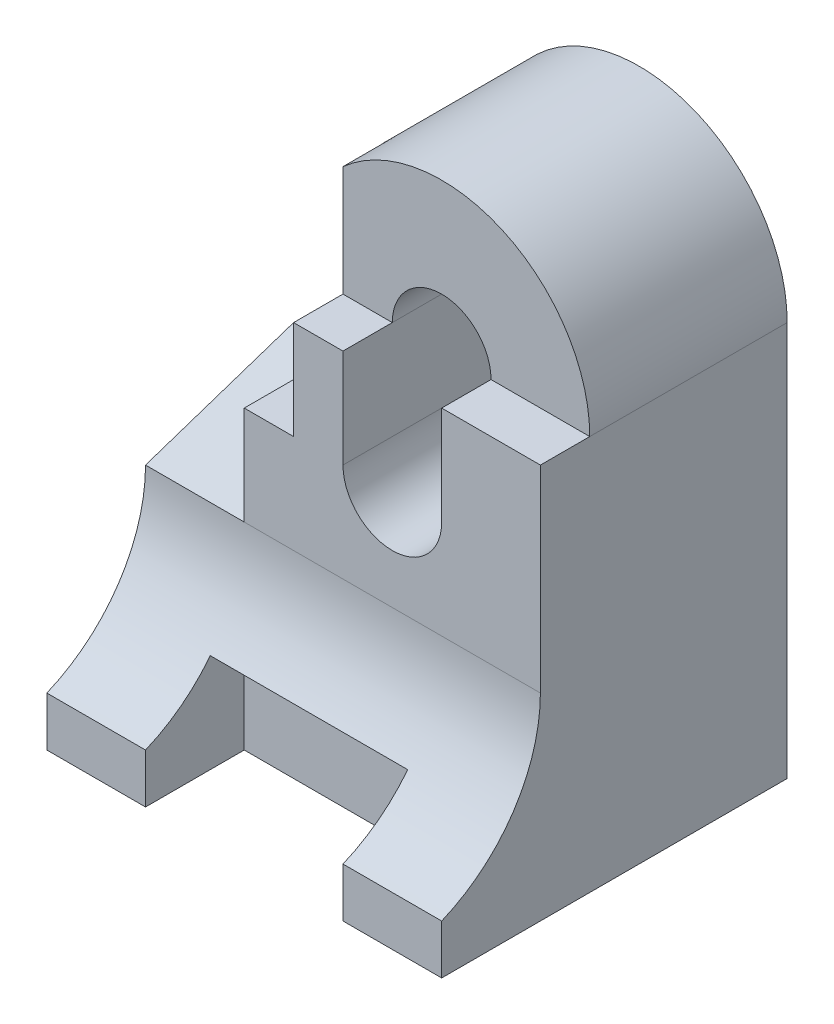
ISO-10303-21;
HEADER;
FILE_DESCRIPTION(('STEP AP214'),'2;1');
FILE_NAME('part.step','',(''),(''),'','','');
FILE_SCHEMA(('AUTOMOTIVE_DESIGN { 1 0 10303 214 1 1 1 1 }'));
ENDSEC;
DATA;
#1=APPLICATION_CONTEXT('core data for automotive mechanical design processes');
#2=APPLICATION_PROTOCOL_DEFINITION('international standard','automotive_design',2000,#1);
#3=PRODUCT_CONTEXT('',#1,'mechanical');
#4=PRODUCT('Part','Part','',(#3));
#5=PRODUCT_RELATED_PRODUCT_CATEGORY('part','',(#4));
#6=PRODUCT_DEFINITION_FORMATION('','',#4);
#7=PRODUCT_DEFINITION_CONTEXT('part definition',#1,'design');
#8=PRODUCT_DEFINITION('design','',#6,#7);
#9=PRODUCT_DEFINITION_SHAPE('','',#8);
#10=(LENGTH_UNIT() NAMED_UNIT(*) SI_UNIT(.MILLI.,.METRE.));
#11=(NAMED_UNIT(*) PLANE_ANGLE_UNIT() SI_UNIT($,.RADIAN.));
#12=(NAMED_UNIT(*) SI_UNIT($,.STERADIAN.) SOLID_ANGLE_UNIT());
#13=UNCERTAINTY_MEASURE_WITH_UNIT(LENGTH_MEASURE(1.E-05),#10,'distance_accuracy_value','');
#14=(GEOMETRIC_REPRESENTATION_CONTEXT(3) GLOBAL_UNCERTAINTY_ASSIGNED_CONTEXT((#13)) GLOBAL_UNIT_ASSIGNED_CONTEXT((#10,
#11,#12)) REPRESENTATION_CONTEXT('',''));
#15=CARTESIAN_POINT('',(0.,0.,0.));
#16=DIRECTION('',(0.,0.,1.));
#17=DIRECTION('',(1.,0.,0.));
#18=AXIS2_PLACEMENT_3D('',#15,#16,#17);
#19=CARTESIAN_POINT('',(-2.,2.,5.));
#20=DIRECTION('',(1.,0.,0.));
#21=DIRECTION('',(0.,0.,-1.));
#22=AXIS2_PLACEMENT_3D('',#19,#20,#21);
#23=PLANE('',#22);
#24=DIRECTION('',(0.,0.316227766016838,-0.948683298050514));
#25=VECTOR('',#24,1.);
#26=CARTESIAN_POINT('',(-2.,3.,2.));
#27=LINE('',#26,#25);
#28=CARTESIAN_POINT('',(-2.,2.,5.));
#29=VERTEX_POINT('',#28);
#30=CARTESIAN_POINT('',(-2.,3.,2.));
#31=VERTEX_POINT('',#30);
#32=EDGE_CURVE('E478',#29,#31,#27,.T.);
#33=ORIENTED_EDGE('',*,*,#32,.F.);
#34=DIRECTION('',(0.,-1.,0.));
#35=VECTOR('',#34,1.);
#36=CARTESIAN_POINT('',(-2.,2.,5.));
#37=LINE('',#36,#35);
#38=CARTESIAN_POINT('',(-2.,4.,5.));
#39=VERTEX_POINT('',#38);
#40=EDGE_CURVE('E217',#39,#29,#37,.T.);
#41=ORIENTED_EDGE('',*,*,#40,.F.);
#42=DIRECTION('',(0.,0.,1.));
#43=VECTOR('',#42,1.);
#44=CARTESIAN_POINT('',(-2.,4.,3.));
#45=LINE('',#44,#43);
#46=CARTESIAN_POINT('',(-2.,4.,3.));
#47=VERTEX_POINT('',#46);
#48=EDGE_CURVE('E440',#47,#39,#45,.T.);
#49=ORIENTED_EDGE('',*,*,#48,.F.);
#50=DIRECTION('',(0.,-1.,0.));
#51=VECTOR('',#50,1.);
#52=CARTESIAN_POINT('',(-2.,4.,3.));
#53=LINE('',#52,#51);
#54=CARTESIAN_POINT('',(-2.,5.99999999999998,3.));
#55=VERTEX_POINT('',#54);
#56=EDGE_CURVE('E449',#55,#47,#53,.T.);
#57=ORIENTED_EDGE('',*,*,#56,.F.);
#58=DIRECTION('',(0.,0.,-1.));
#59=VECTOR('',#58,1.);
#60=CARTESIAN_POINT('',(-2.,6.,5.));
#61=LINE('',#60,#59);
#62=CARTESIAN_POINT('',(-2.,6.,1.));
#63=VERTEX_POINT('',#62);
#64=EDGE_CURVE('E216',#55,#63,#61,.T.);
#65=ORIENTED_EDGE('',*,*,#64,.T.);
#66=DIRECTION('',(0.,-1.,0.));
#67=VECTOR('',#66,1.);
#68=CARTESIAN_POINT('',(-2.,6.,1.));
#69=LINE('',#68,#67);
#70=CARTESIAN_POINT('',(-2.,3.,1.));
#71=VERTEX_POINT('',#70);
#72=EDGE_CURVE('E464',#63,#71,#69,.T.);
#73=ORIENTED_EDGE('',*,*,#72,.T.);
#74=DIRECTION('',(0.,0.,-1.));
#75=VECTOR('',#74,1.);
#76=CARTESIAN_POINT('',(-2.,3.,1.));
#77=LINE('',#76,#75);
#78=EDGE_CURVE('E205',#31,#71,#77,.T.);
#79=ORIENTED_EDGE('',*,*,#78,.F.);
#80=EDGE_LOOP('',(#33,#41,#49,#57,#65,#73,#79));
#81=FACE_BOUND('',#80,.T.);
#82=ADVANCED_FACE('F33',(#81),#23,.F.);
#83=CARTESIAN_POINT('',(0.,0.,1.));
#84=DIRECTION('',(0.,0.,-1.));
#85=DIRECTION('',(-1.,0.,0.));
#86=AXIS2_PLACEMENT_3D('',#83,#84,#85);
#87=PLANE('',#86);
#88=DIRECTION('',(1.,0.,0.));
#89=VECTOR('',#88,1.);
#90=CARTESIAN_POINT('',(-4.,3.,1.));
#91=LINE('',#90,#89);
#92=CARTESIAN_POINT('',(-4.,3.,1.));
#93=VERTEX_POINT('',#92);
#94=EDGE_CURVE('E474',#93,#71,#91,.T.);
#95=ORIENTED_EDGE('',*,*,#94,.T.);
#96=ORIENTED_EDGE('',*,*,#72,.F.);
#97=DIRECTION('',(0.554700196225229,0.832050294337844,0.));
#98=VECTOR('',#97,1.);
#99=CARTESIAN_POINT('',(-4.,3.,1.));
#100=LINE('',#99,#98);
#101=EDGE_CURVE('E468',#93,#63,#100,.T.);
#102=ORIENTED_EDGE('',*,*,#101,.F.);
#103=EDGE_LOOP('',(#95,#96,#102));
#104=FACE_BOUND('',#103,.T.);
#105=ADVANCED_FACE('F371',(#104),#87,.F.);
#106=CARTESIAN_POINT('',(1.,6.,5.));
#107=DIRECTION('',(0.,0.,-1.));
#108=DIRECTION('',(-1.,0.,0.));
#109=AXIS2_PLACEMENT_3D('',#106,#107,#108);
#110=CYLINDRICAL_SURFACE('',#109,3.);
#111=CARTESIAN_POINT('',(1.,6.,3.));
#112=DIRECTION('',(0.,0.,1.));
#113=DIRECTION('',(1.,0.,0.));
#114=AXIS2_PLACEMENT_3D('',#111,#112,#113);
#115=CIRCLE('',#114,3.);
#116=CARTESIAN_POINT('',(-1.,8.23606797749979,3.));
#117=VERTEX_POINT('',#116);
#118=EDGE_CURVE('E443',#117,#55,#115,.T.);
#119=ORIENTED_EDGE('',*,*,#118,.F.);
#120=DIRECTION('',(0.,0.,1.));
#121=VECTOR('',#120,1.);
#122=CARTESIAN_POINT('',(-1.,8.23606797749979,3.));
#123=LINE('',#122,#121);
#124=CARTESIAN_POINT('',(-1.,8.23606797749979,4.));
#125=VERTEX_POINT('',#124);
#126=EDGE_CURVE('E433',#117,#125,#123,.T.);
#127=ORIENTED_EDGE('',*,*,#126,.T.);
#128=CARTESIAN_POINT('',(1.,6.,4.));
#129=DIRECTION('',(0.,0.,1.));
#130=DIRECTION('',(1.,0.,0.));
#131=AXIS2_PLACEMENT_3D('',#128,#129,#130);
#132=CIRCLE('',#131,3.);
#133=CARTESIAN_POINT('',(4.,6.,4.));
#134=VERTEX_POINT('',#133);
#135=EDGE_CURVE('E427',#134,#125,#132,.T.);
#136=ORIENTED_EDGE('',*,*,#135,.F.);
#137=DIRECTION('',(0.,0.,-1.));
#138=VECTOR('',#137,1.);
#139=CARTESIAN_POINT('',(4.,6.,5.));
#140=LINE('',#139,#138);
#141=CARTESIAN_POINT('',(4.,6.,0.));
#142=VERTEX_POINT('',#141);
#143=EDGE_CURVE('E292',#134,#142,#140,.T.);
#144=ORIENTED_EDGE('',*,*,#143,.T.);
#145=CARTESIAN_POINT('',(1.,6.,0.));
#146=DIRECTION('',(0.,0.,1.));
#147=DIRECTION('',(-1.,0.,0.));
#148=AXIS2_PLACEMENT_3D('',#145,#146,#147);
#149=CIRCLE('',#148,3.);
#150=CARTESIAN_POINT('',(-2.,6.,0.));
#151=VERTEX_POINT('',#150);
#152=EDGE_CURVE('E280',#142,#151,#149,.T.);
#153=ORIENTED_EDGE('',*,*,#152,.T.);
#154=DIRECTION('',(0.,0.,-1.));
#155=VECTOR('',#154,1.);
#156=CARTESIAN_POINT('',(-2.,6.,1.));
#157=LINE('',#156,#155);
#158=EDGE_CURVE('E48',#63,#151,#157,.T.);
#159=ORIENTED_EDGE('',*,*,#158,.F.);
#160=ORIENTED_EDGE('',*,*,#64,.F.);
#161=EDGE_LOOP('',(#119,#127,#136,#144,#153,#159,#160));
#162=FACE_BOUND('',#161,.T.);
#163=ADVANCED_FACE('F377',(#162),#110,.T.);
#164=CARTESIAN_POINT('',(1.,6.,5.));
#165=DIRECTION('',(0.,0.,-1.));
#166=DIRECTION('',(-1.,0.,0.));
#167=AXIS2_PLACEMENT_3D('',#164,#165,#166);
#168=CYLINDRICAL_SURFACE('',#167,1.);
#169=DIRECTION('',(0.,0.,-1.));
#170=VECTOR('',#169,1.);
#171=CARTESIAN_POINT('',(2.,6.,5.));
#172=LINE('',#171,#170);
#173=CARTESIAN_POINT('',(2.,6.,4.));
#174=VERTEX_POINT('',#173);
#175=CARTESIAN_POINT('',(2.,6.,0.));
#176=VERTEX_POINT('',#175);
#177=EDGE_CURVE('E254',#174,#176,#172,.T.);
#178=ORIENTED_EDGE('',*,*,#177,.F.);
#179=CARTESIAN_POINT('',(1.,6.,4.));
#180=DIRECTION('',(0.,0.,-1.));
#181=DIRECTION('',(-1.,0.,0.));
#182=AXIS2_PLACEMENT_3D('',#179,#180,#181);
#183=CIRCLE('',#182,1.);
#184=CARTESIAN_POINT('',(0.,6.,4.));
#185=VERTEX_POINT('',#184);
#186=EDGE_CURVE('E414',#185,#174,#183,.T.);
#187=ORIENTED_EDGE('',*,*,#186,.F.);
#188=DIRECTION('',(0.,0.,-1.));
#189=VECTOR('',#188,1.);
#190=CARTESIAN_POINT('',(0.,6.,5.));
#191=LINE('',#190,#189);
#192=CARTESIAN_POINT('',(0.,6.,0.));
#193=VERTEX_POINT('',#192);
#194=EDGE_CURVE('E272',#185,#193,#191,.T.);
#195=ORIENTED_EDGE('',*,*,#194,.T.);
#196=CARTESIAN_POINT('',(1.,6.,0.));
#197=DIRECTION('',(0.,0.,1.));
#198=DIRECTION('',(1.,0.,0.));
#199=AXIS2_PLACEMENT_3D('',#196,#197,#198);
#200=CIRCLE('',#199,1.);
#201=EDGE_CURVE('E239',#176,#193,#200,.T.);
#202=ORIENTED_EDGE('',*,*,#201,.F.);
#203=EDGE_LOOP('',(#178,#187,#195,#202));
#204=FACE_BOUND('',#203,.T.);
#205=ADVANCED_FACE('F368',(#204),#168,.F.);
#206=CARTESIAN_POINT('',(-4.,-2.,7.));
#207=DIRECTION('',(0.,0.,1.));
#208=DIRECTION('',(1.,0.,0.));
#209=AXIS2_PLACEMENT_3D('',#206,#207,#208);
#210=PLANE('',#209);
#211=DIRECTION('',(0.,-1.,0.));
#212=VECTOR('',#211,1.);
#213=CARTESIAN_POINT('',(2.,0.,7.));
#214=LINE('',#213,#212);
#215=CARTESIAN_POINT('',(2.,-1.,7.));
#216=VERTEX_POINT('',#215);
#217=CARTESIAN_POINT('',(2.,-2.,7.));
#218=VERTEX_POINT('',#217);
#219=EDGE_CURVE('E234',#216,#218,#214,.T.);
#220=ORIENTED_EDGE('',*,*,#219,.T.);
#221=DIRECTION('',(1.,0.,0.));
#222=VECTOR('',#221,1.);
#223=CARTESIAN_POINT('',(-4.,-2.,7.));
#224=LINE('',#223,#222);
#225=CARTESIAN_POINT('',(4.,-2.,7.));
#226=VERTEX_POINT('',#225);
#227=EDGE_CURVE('E240',#218,#226,#224,.T.);
#228=ORIENTED_EDGE('',*,*,#227,.T.);
#229=DIRECTION('',(0.,-1.,0.));
#230=VECTOR('',#229,1.);
#231=CARTESIAN_POINT('',(4.,-2.,7.));
#232=LINE('',#231,#230);
#233=CARTESIAN_POINT('',(4.,-1.,7.));
#234=VERTEX_POINT('',#233);
#235=EDGE_CURVE('E223',#234,#226,#232,.T.);
#236=ORIENTED_EDGE('',*,*,#235,.F.);
#237=DIRECTION('',(1.,0.,0.));
#238=VECTOR('',#237,1.);
#239=CARTESIAN_POINT('',(-4.,-1.,7.));
#240=LINE('',#239,#238);
#241=EDGE_CURVE('E243',#216,#234,#240,.T.);
#242=ORIENTED_EDGE('',*,*,#241,.F.);
#243=EDGE_LOOP('',(#220,#228,#236,#242));
#244=FACE_BOUND('',#243,.T.);
#245=ADVANCED_FACE('F356',(#244),#210,.T.);
#246=CARTESIAN_POINT('',(1.,6.,5.));
#247=DIRECTION('',(0.,0.,-1.));
#248=DIRECTION('',(-1.,0.,0.));
#249=AXIS2_PLACEMENT_3D('',#246,#247,#248);
#250=PLANE('',#249);
#251=DIRECTION('',(1.,0.,0.));
#252=VECTOR('',#251,1.);
#253=CARTESIAN_POINT('',(0.,6.,5.));
#254=LINE('',#253,#252);
#255=CARTESIAN_POINT('',(-1.,5.99999999999998,5.));
#256=VERTEX_POINT('',#255);
#257=CARTESIAN_POINT('',(0.,6.,5.));
#258=VERTEX_POINT('',#257);
#259=EDGE_CURVE('E428',#256,#258,#254,.T.);
#260=ORIENTED_EDGE('',*,*,#259,.F.);
#261=DIRECTION('',(0.,1.,0.));
#262=VECTOR('',#261,1.);
#263=CARTESIAN_POINT('',(-1.,4.,5.));
#264=LINE('',#263,#262);
#265=CARTESIAN_POINT('',(-1.,4.,5.));
#266=VERTEX_POINT('',#265);
#267=EDGE_CURVE('E447',#266,#256,#264,.T.);
#268=ORIENTED_EDGE('',*,*,#267,.F.);
#269=DIRECTION('',(1.,0.,0.));
#270=VECTOR('',#269,1.);
#271=CARTESIAN_POINT('',(-2.,4.,5.));
#272=LINE('',#271,#270);
#273=EDGE_CURVE('E450',#39,#266,#272,.T.);
#274=ORIENTED_EDGE('',*,*,#273,.F.);
#275=ORIENTED_EDGE('',*,*,#40,.T.);
#276=DIRECTION('',(1.,0.,0.));
#277=VECTOR('',#276,1.);
#278=CARTESIAN_POINT('',(-4.,2.,5.));
#279=LINE('',#278,#277);
#280=CARTESIAN_POINT('',(4.,2.,5.));
#281=VERTEX_POINT('',#280);
#282=EDGE_CURVE('E215',#29,#281,#279,.T.);
#283=ORIENTED_EDGE('',*,*,#282,.T.);
#284=DIRECTION('',(0.,1.,0.));
#285=VECTOR('',#284,1.);
#286=CARTESIAN_POINT('',(4.,-2.,5.));
#287=LINE('',#286,#285);
#288=CARTESIAN_POINT('',(4.,6.,5.));
#289=VERTEX_POINT('',#288);
#290=EDGE_CURVE('E277',#281,#289,#287,.T.);
#291=ORIENTED_EDGE('',*,*,#290,.T.);
#292=DIRECTION('',(1.,0.,0.));
#293=VECTOR('',#292,1.);
#294=CARTESIAN_POINT('',(4.,6.,5.));
#295=LINE('',#294,#293);
#296=CARTESIAN_POINT('',(2.,6.,5.));
#297=VERTEX_POINT('',#296);
#298=EDGE_CURVE('E332',#297,#289,#295,.T.);
#299=ORIENTED_EDGE('',*,*,#298,.F.);
#300=DIRECTION('',(0.,1.,0.));
#301=VECTOR('',#300,1.);
#302=CARTESIAN_POINT('',(2.,6.,5.));
#303=LINE('',#302,#301);
#304=CARTESIAN_POINT('',(2.,4.,5.));
#305=VERTEX_POINT('',#304);
#306=EDGE_CURVE('E251',#305,#297,#303,.T.);
#307=ORIENTED_EDGE('',*,*,#306,.F.);
#308=CARTESIAN_POINT('',(1.,4.,5.));
#309=DIRECTION('',(0.,0.,1.));
#310=DIRECTION('',(1.,0.,0.));
#311=AXIS2_PLACEMENT_3D('',#308,#309,#310);
#312=CIRCLE('',#311,1.);
#313=CARTESIAN_POINT('',(0.,4.,5.));
#314=VERTEX_POINT('',#313);
#315=EDGE_CURVE('E247',#314,#305,#312,.T.);
#316=ORIENTED_EDGE('',*,*,#315,.F.);
#317=DIRECTION('',(0.,-1.,0.));
#318=VECTOR('',#317,1.);
#319=CARTESIAN_POINT('',(0.,6.,5.));
#320=LINE('',#319,#318);
#321=EDGE_CURVE('E245',#258,#314,#320,.T.);
#322=ORIENTED_EDGE('',*,*,#321,.F.);
#323=EDGE_LOOP('',(#260,#268,#274,#275,#283,#291,#299,#307,#316,#322));
#324=FACE_BOUND('',#323,.T.);
#325=ADVANCED_FACE('F367',(#324),#250,.F.);
#326=CARTESIAN_POINT('',(1.,6.,0.));
#327=DIRECTION('',(0.,0.,-1.));
#328=DIRECTION('',(-1.,0.,0.));
#329=AXIS2_PLACEMENT_3D('',#326,#327,#328);
#330=PLANE('',#329);
#331=DIRECTION('',(0.,-1.,0.));
#332=VECTOR('',#331,1.);
#333=CARTESIAN_POINT('',(-4.,-2.,0.));
#334=LINE('',#333,#332);
#335=CARTESIAN_POINT('',(-4.,3.,0.));
#336=VERTEX_POINT('',#335);
#337=CARTESIAN_POINT('',(-4.,-2.,0.));
#338=VERTEX_POINT('',#337);
#339=EDGE_CURVE('E276',#336,#338,#334,.T.);
#340=ORIENTED_EDGE('',*,*,#339,.F.);
#341=DIRECTION('',(0.554700196225229,0.832050294337844,0.));
#342=VECTOR('',#341,1.);
#343=CARTESIAN_POINT('',(-4.,3.,0.));
#344=LINE('',#343,#342);
#345=EDGE_CURVE('E466',#336,#151,#344,.T.);
#346=ORIENTED_EDGE('',*,*,#345,.T.);
#347=ORIENTED_EDGE('',*,*,#152,.F.);
#348=DIRECTION('',(0.,1.,0.));
#349=VECTOR('',#348,1.);
#350=CARTESIAN_POINT('',(4.,2.,0.));
#351=LINE('',#350,#349);
#352=CARTESIAN_POINT('',(4.,-2.,0.));
#353=VERTEX_POINT('',#352);
#354=EDGE_CURVE('E287',#353,#142,#351,.T.);
#355=ORIENTED_EDGE('',*,*,#354,.F.);
#356=DIRECTION('',(1.,0.,0.));
#357=VECTOR('',#356,1.);
#358=CARTESIAN_POINT('',(4.,-2.,0.));
#359=LINE('',#358,#357);
#360=EDGE_CURVE('E284',#338,#353,#359,.T.);
#361=ORIENTED_EDGE('',*,*,#360,.F.);
#362=EDGE_LOOP('',(#340,#346,#347,#355,#361));
#363=FACE_BOUND('',#362,.T.);
#364=DIRECTION('',(0.,1.,0.));
#365=VECTOR('',#364,1.);
#366=CARTESIAN_POINT('',(2.,6.,0.));
#367=LINE('',#366,#365);
#368=CARTESIAN_POINT('',(2.,4.,0.));
#369=VERTEX_POINT('',#368);
#370=EDGE_CURVE('E248',#369,#176,#367,.T.);
#371=ORIENTED_EDGE('',*,*,#370,.T.);
#372=ORIENTED_EDGE('',*,*,#201,.T.);
#373=DIRECTION('',(0.,-1.,0.));
#374=VECTOR('',#373,1.);
#375=CARTESIAN_POINT('',(0.,6.,0.));
#376=LINE('',#375,#374);
#377=CARTESIAN_POINT('',(0.,4.,0.));
#378=VERTEX_POINT('',#377);
#379=EDGE_CURVE('E257',#193,#378,#376,.T.);
#380=ORIENTED_EDGE('',*,*,#379,.T.);
#381=CARTESIAN_POINT('',(1.,4.,0.));
#382=DIRECTION('',(0.,0.,1.));
#383=DIRECTION('',(1.,0.,0.));
#384=AXIS2_PLACEMENT_3D('',#381,#382,#383);
#385=CIRCLE('',#384,1.);
#386=EDGE_CURVE('E260',#378,#369,#385,.T.);
#387=ORIENTED_EDGE('',*,*,#386,.T.);
#388=EDGE_LOOP('',(#371,#372,#380,#387));
#389=FACE_BOUND('',#388,.T.);
#390=ADVANCED_FACE('F382',(#363,#389),#330,.T.);
#391=CARTESIAN_POINT('',(-4.,-2.,5.));
#392=DIRECTION('',(1.,0.,0.));
#393=DIRECTION('',(0.,0.,-1.));
#394=AXIS2_PLACEMENT_3D('',#391,#392,#393);
#395=PLANE('',#394);
#396=ORIENTED_EDGE('',*,*,#339,.T.);
#397=DIRECTION('',(0.,0.,-1.));
#398=VECTOR('',#397,1.);
#399=CARTESIAN_POINT('',(-4.,-2.,5.));
#400=LINE('',#399,#398);
#401=CARTESIAN_POINT('',(-4.,-2.,7.));
#402=VERTEX_POINT('',#401);
#403=EDGE_CURVE('E298',#402,#338,#400,.T.);
#404=ORIENTED_EDGE('',*,*,#403,.F.);
#405=DIRECTION('',(0.,-1.,0.));
#406=VECTOR('',#405,1.);
#407=CARTESIAN_POINT('',(-4.,-2.,7.));
#408=LINE('',#407,#406);
#409=CARTESIAN_POINT('',(-4.,-1.,7.));
#410=VERTEX_POINT('',#409);
#411=EDGE_CURVE('E222',#410,#402,#408,.T.);
#412=ORIENTED_EDGE('',*,*,#411,.F.);
#413=CARTESIAN_POINT('',(-4.,2.,8.25));
#414=DIRECTION('',(-1.,0.,0.));
#415=DIRECTION('',(0.,0.,-1.));
#416=AXIS2_PLACEMENT_3D('',#413,#414,#415);
#417=CIRCLE('',#416,3.25);
#418=CARTESIAN_POINT('',(-4.,2.,5.));
#419=VERTEX_POINT('',#418);
#420=EDGE_CURVE('E213',#419,#410,#417,.T.);
#421=ORIENTED_EDGE('',*,*,#420,.F.);
#422=DIRECTION('',(0.,0.316227766016838,-0.948683298050514));
#423=VECTOR('',#422,1.);
#424=CARTESIAN_POINT('',(-4.,3.,2.));
#425=LINE('',#424,#423);
#426=CARTESIAN_POINT('',(-4.,3.,2.));
#427=VERTEX_POINT('',#426);
#428=EDGE_CURVE('E193',#419,#427,#425,.T.);
#429=ORIENTED_EDGE('',*,*,#428,.T.);
#430=DIRECTION('',(0.,0.,-1.));
#431=VECTOR('',#430,1.);
#432=CARTESIAN_POINT('',(-4.,3.,1.));
#433=LINE('',#432,#431);
#434=EDGE_CURVE('E204',#427,#93,#433,.T.);
#435=ORIENTED_EDGE('',*,*,#434,.T.);
#436=DIRECTION('',(0.,0.,-1.));
#437=VECTOR('',#436,1.);
#438=CARTESIAN_POINT('',(-4.,3.,1.));
#439=LINE('',#438,#437);
#440=EDGE_CURVE('E462',#93,#336,#439,.T.);
#441=ORIENTED_EDGE('',*,*,#440,.T.);
#442=EDGE_LOOP('',(#396,#404,#412,#421,#429,#435,#441));
#443=FACE_BOUND('',#442,.T.);
#444=ADVANCED_FACE('F35',(#443),#395,.F.);
#445=CARTESIAN_POINT('',(4.,-2.,5.));
#446=DIRECTION('',(0.,1.,0.));
#447=DIRECTION('',(-1.,0.,0.));
#448=AXIS2_PLACEMENT_3D('',#445,#446,#447);
#449=PLANE('',#448);
#450=ORIENTED_EDGE('',*,*,#227,.F.);
#451=DIRECTION('',(0.,0.,1.));
#452=VECTOR('',#451,1.);
#453=CARTESIAN_POINT('',(2.,-2.,7.));
#454=LINE('',#453,#452);
#455=CARTESIAN_POINT('',(2.,-2.,5.));
#456=VERTEX_POINT('',#455);
#457=EDGE_CURVE('E326',#456,#218,#454,.T.);
#458=ORIENTED_EDGE('',*,*,#457,.F.);
#459=DIRECTION('',(1.,0.,0.));
#460=VECTOR('',#459,1.);
#461=CARTESIAN_POINT('',(2.,-2.,5.));
#462=LINE('',#461,#460);
#463=CARTESIAN_POINT('',(-2.,-2.,5.));
#464=VERTEX_POINT('',#463);
#465=EDGE_CURVE('E329',#464,#456,#462,.T.);
#466=ORIENTED_EDGE('',*,*,#465,.F.);
#467=DIRECTION('',(0.,0.,-1.));
#468=VECTOR('',#467,1.);
#469=CARTESIAN_POINT('',(-2.,-2.,5.));
#470=LINE('',#469,#468);
#471=CARTESIAN_POINT('',(-2.,-2.,7.));
#472=VERTEX_POINT('',#471);
#473=EDGE_CURVE('E336',#472,#464,#470,.T.);
#474=ORIENTED_EDGE('',*,*,#473,.F.);
#475=EDGE_CURVE('E236',#402,#472,#224,.T.);
#476=ORIENTED_EDGE('',*,*,#475,.F.);
#477=ORIENTED_EDGE('',*,*,#403,.T.);
#478=ORIENTED_EDGE('',*,*,#360,.T.);
#479=DIRECTION('',(0.,0.,-1.));
#480=VECTOR('',#479,1.);
#481=CARTESIAN_POINT('',(4.,-2.,5.));
#482=LINE('',#481,#480);
#483=EDGE_CURVE('E295',#226,#353,#482,.T.);
#484=ORIENTED_EDGE('',*,*,#483,.F.);
#485=EDGE_LOOP('',(#450,#458,#466,#474,#476,#477,#478,#484));
#486=FACE_BOUND('',#485,.T.);
#487=ADVANCED_FACE('F350',(#486),#449,.F.);
#488=CARTESIAN_POINT('',(4.,2.,5.));
#489=DIRECTION('',(-1.,0.,0.));
#490=DIRECTION('',(0.,0.,1.));
#491=AXIS2_PLACEMENT_3D('',#488,#489,#490);
#492=PLANE('',#491);
#493=ORIENTED_EDGE('',*,*,#354,.T.);
#494=ORIENTED_EDGE('',*,*,#143,.F.);
#495=EDGE_CURVE('E293',#289,#134,#140,.T.);
#496=ORIENTED_EDGE('',*,*,#495,.F.);
#497=ORIENTED_EDGE('',*,*,#290,.F.);
#498=CARTESIAN_POINT('',(4.,2.,8.25));
#499=DIRECTION('',(-1.,0.,0.));
#500=DIRECTION('',(0.,0.,-1.));
#501=AXIS2_PLACEMENT_3D('',#498,#499,#500);
#502=CIRCLE('',#501,3.25);
#503=EDGE_CURVE('E227',#281,#234,#502,.T.);
#504=ORIENTED_EDGE('',*,*,#503,.T.);
#505=ORIENTED_EDGE('',*,*,#235,.T.);
#506=ORIENTED_EDGE('',*,*,#483,.T.);
#507=EDGE_LOOP('',(#493,#494,#496,#497,#504,#505,#506));
#508=FACE_BOUND('',#507,.T.);
#509=ADVANCED_FACE('F386',(#508),#492,.F.);
#510=CARTESIAN_POINT('',(0.,6.,5.));
#511=DIRECTION('',(1.,0.,0.));
#512=DIRECTION('',(0.,0.,-1.));
#513=AXIS2_PLACEMENT_3D('',#510,#511,#512);
#514=PLANE('',#513);
#515=ORIENTED_EDGE('',*,*,#379,.F.);
#516=ORIENTED_EDGE('',*,*,#194,.F.);
#517=EDGE_CURVE('E273',#258,#185,#191,.T.);
#518=ORIENTED_EDGE('',*,*,#517,.F.);
#519=ORIENTED_EDGE('',*,*,#321,.T.);
#520=DIRECTION('',(0.,0.,-1.));
#521=VECTOR('',#520,1.);
#522=CARTESIAN_POINT('',(0.,4.,5.));
#523=LINE('',#522,#521);
#524=EDGE_CURVE('E270',#314,#378,#523,.T.);
#525=ORIENTED_EDGE('',*,*,#524,.T.);
#526=EDGE_LOOP('',(#515,#516,#518,#519,#525));
#527=FACE_BOUND('',#526,.T.);
#528=ADVANCED_FACE('F388',(#527),#514,.T.);
#529=CARTESIAN_POINT('',(1.,4.,5.));
#530=DIRECTION('',(0.,0.,-1.));
#531=DIRECTION('',(-1.,0.,0.));
#532=AXIS2_PLACEMENT_3D('',#529,#530,#531);
#533=CYLINDRICAL_SURFACE('',#532,1.);
#534=ORIENTED_EDGE('',*,*,#386,.F.);
#535=ORIENTED_EDGE('',*,*,#524,.F.);
#536=ORIENTED_EDGE('',*,*,#315,.T.);
#537=DIRECTION('',(0.,0.,-1.));
#538=VECTOR('',#537,1.);
#539=CARTESIAN_POINT('',(2.,4.,5.));
#540=LINE('',#539,#538);
#541=EDGE_CURVE('E268',#305,#369,#540,.T.);
#542=ORIENTED_EDGE('',*,*,#541,.T.);
#543=EDGE_LOOP('',(#534,#535,#536,#542));
#544=FACE_BOUND('',#543,.T.);
#545=ADVANCED_FACE('F362',(#544),#533,.F.);
#546=CARTESIAN_POINT('',(2.,6.,5.));
#547=DIRECTION('',(-1.,0.,0.));
#548=DIRECTION('',(0.,-1.,0.));
#549=AXIS2_PLACEMENT_3D('',#546,#547,#548);
#550=PLANE('',#549);
#551=ORIENTED_EDGE('',*,*,#370,.F.);
#552=ORIENTED_EDGE('',*,*,#541,.F.);
#553=ORIENTED_EDGE('',*,*,#306,.T.);
#554=EDGE_CURVE('E265',#297,#174,#172,.T.);
#555=ORIENTED_EDGE('',*,*,#554,.T.);
#556=ORIENTED_EDGE('',*,*,#177,.T.);
#557=EDGE_LOOP('',(#551,#552,#553,#555,#556));
#558=FACE_BOUND('',#557,.T.);
#559=ADVANCED_FACE('F354',(#558),#550,.T.);
#560=DIRECTION('',(0.,-1.,0.));
#561=VECTOR('',#560,1.);
#562=CARTESIAN_POINT('',(-2.,0.,7.));
#563=LINE('',#562,#561);
#564=CARTESIAN_POINT('',(-2.,-1.,7.));
#565=VERTEX_POINT('',#564);
#566=EDGE_CURVE('E230',#565,#472,#563,.T.);
#567=ORIENTED_EDGE('',*,*,#566,.F.);
#568=EDGE_CURVE('E241',#410,#565,#240,.T.);
#569=ORIENTED_EDGE('',*,*,#568,.F.);
#570=ORIENTED_EDGE('',*,*,#411,.T.);
#571=ORIENTED_EDGE('',*,*,#475,.T.);
#572=EDGE_LOOP('',(#567,#569,#570,#571));
#573=FACE_BOUND('',#572,.T.);
#574=ADVANCED_FACE('F352',(#573),#210,.T.);
#575=CARTESIAN_POINT('',(-4.,2.,8.25));
#576=DIRECTION('',(1.,0.,0.));
#577=DIRECTION('',(0.,0.,-1.));
#578=AXIS2_PLACEMENT_3D('',#575,#576,#577);
#579=CYLINDRICAL_SURFACE('',#578,3.25);
#580=CARTESIAN_POINT('',(2.,2.,8.25));
#581=DIRECTION('',(1.,0.,0.));
#582=DIRECTION('',(0.,0.,-1.));
#583=AXIS2_PLACEMENT_3D('',#580,#581,#582);
#584=CIRCLE('',#583,3.25);
#585=CARTESIAN_POINT('',(2.,0.,5.6882623085101));
#586=VERTEX_POINT('',#585);
#587=EDGE_CURVE('E41',#216,#586,#584,.T.);
#588=ORIENTED_EDGE('',*,*,#587,.F.);
#589=ORIENTED_EDGE('',*,*,#241,.T.);
#590=ORIENTED_EDGE('',*,*,#503,.F.);
#591=ORIENTED_EDGE('',*,*,#282,.F.);
#592=DIRECTION('',(-1.,0.,0.));
#593=VECTOR('',#592,1.);
#594=CARTESIAN_POINT('',(-2.,2.,5.));
#595=LINE('',#594,#593);
#596=EDGE_CURVE('E196',#29,#419,#595,.T.);
#597=ORIENTED_EDGE('',*,*,#596,.T.);
#598=ORIENTED_EDGE('',*,*,#420,.T.);
#599=ORIENTED_EDGE('',*,*,#568,.T.);
#600=CARTESIAN_POINT('',(-2.,2.,8.25));
#601=DIRECTION('',(-1.,0.,0.));
#602=DIRECTION('',(0.,0.,1.));
#603=AXIS2_PLACEMENT_3D('',#600,#601,#602);
#604=CIRCLE('',#603,3.25);
#605=CARTESIAN_POINT('',(-2.,0.,5.6882623085101));
#606=VERTEX_POINT('',#605);
#607=EDGE_CURVE('E303',#606,#565,#604,.T.);
#608=ORIENTED_EDGE('',*,*,#607,.F.);
#609=DIRECTION('',(1.,0.,0.));
#610=VECTOR('',#609,1.);
#611=CARTESIAN_POINT('',(-4.,0.,5.6882623085101));
#612=LINE('',#611,#610);
#613=EDGE_CURVE('E301',#586,#606,#612,.F.);
#614=ORIENTED_EDGE('',*,*,#613,.F.);
#615=EDGE_LOOP('',(#588,#589,#590,#591,#597,#598,#599,#608,#614));
#616=FACE_BOUND('',#615,.T.);
#617=ADVANCED_FACE('F211',(#616),#579,.F.);
#618=CARTESIAN_POINT('',(2.,0.,7.));
#619=DIRECTION('',(1.,0.,0.));
#620=DIRECTION('',(0.,0.,-1.));
#621=AXIS2_PLACEMENT_3D('',#618,#619,#620);
#622=PLANE('',#621);
#623=ORIENTED_EDGE('',*,*,#587,.T.);
#624=DIRECTION('',(0.,0.,1.));
#625=VECTOR('',#624,1.);
#626=CARTESIAN_POINT('',(2.,0.,7.));
#627=LINE('',#626,#625);
#628=CARTESIAN_POINT('',(2.,0.,5.));
#629=VERTEX_POINT('',#628);
#630=EDGE_CURVE('E309',#629,#586,#627,.T.);
#631=ORIENTED_EDGE('',*,*,#630,.F.);
#632=DIRECTION('',(0.,-1.,0.));
#633=VECTOR('',#632,1.);
#634=CARTESIAN_POINT('',(2.,0.,5.));
#635=LINE('',#634,#633);
#636=EDGE_CURVE('E342',#629,#456,#635,.T.);
#637=ORIENTED_EDGE('',*,*,#636,.T.);
#638=ORIENTED_EDGE('',*,*,#457,.T.);
#639=ORIENTED_EDGE('',*,*,#219,.F.);
#640=EDGE_LOOP('',(#623,#631,#637,#638,#639));
#641=FACE_BOUND('',#640,.T.);
#642=ADVANCED_FACE('F308',(#641),#622,.F.);
#643=CARTESIAN_POINT('',(2.,0.,5.));
#644=DIRECTION('',(0.,0.,-1.));
#645=DIRECTION('',(-1.,0.,0.));
#646=AXIS2_PLACEMENT_3D('',#643,#644,#645);
#647=PLANE('',#646);
#648=ORIENTED_EDGE('',*,*,#465,.T.);
#649=ORIENTED_EDGE('',*,*,#636,.F.);
#650=DIRECTION('',(1.,0.,0.));
#651=VECTOR('',#650,1.);
#652=CARTESIAN_POINT('',(2.,0.,5.));
#653=LINE('',#652,#651);
#654=CARTESIAN_POINT('',(-2.,0.,5.));
#655=VERTEX_POINT('',#654);
#656=EDGE_CURVE('E325',#655,#629,#653,.T.);
#657=ORIENTED_EDGE('',*,*,#656,.F.);
#658=DIRECTION('',(0.,-1.,0.));
#659=VECTOR('',#658,1.);
#660=CARTESIAN_POINT('',(-2.,0.,5.));
#661=LINE('',#660,#659);
#662=EDGE_CURVE('E323',#655,#464,#661,.T.);
#663=ORIENTED_EDGE('',*,*,#662,.T.);
#664=EDGE_LOOP('',(#648,#649,#657,#663));
#665=FACE_BOUND('',#664,.T.);
#666=ADVANCED_FACE('F532',(#665),#647,.F.);
#667=CARTESIAN_POINT('',(-2.,0.,5.));
#668=DIRECTION('',(-1.,0.,0.));
#669=DIRECTION('',(0.,0.,1.));
#670=AXIS2_PLACEMENT_3D('',#667,#668,#669);
#671=PLANE('',#670);
#672=ORIENTED_EDGE('',*,*,#607,.T.);
#673=ORIENTED_EDGE('',*,*,#566,.T.);
#674=ORIENTED_EDGE('',*,*,#473,.T.);
#675=ORIENTED_EDGE('',*,*,#662,.F.);
#676=DIRECTION('',(0.,0.,-1.));
#677=VECTOR('',#676,1.);
#678=CARTESIAN_POINT('',(-2.,0.,5.));
#679=LINE('',#678,#677);
#680=EDGE_CURVE('E317',#606,#655,#679,.T.);
#681=ORIENTED_EDGE('',*,*,#680,.F.);
#682=EDGE_LOOP('',(#672,#673,#674,#675,#681));
#683=FACE_BOUND('',#682,.T.);
#684=ADVANCED_FACE('F320',(#683),#671,.F.);
#685=CARTESIAN_POINT('',(0.,0.,0.));
#686=DIRECTION('',(0.,1.,0.));
#687=DIRECTION('',(0.,0.,1.));
#688=AXIS2_PLACEMENT_3D('',#685,#686,#687);
#689=PLANE('',#688);
#690=ORIENTED_EDGE('',*,*,#613,.T.);
#691=ORIENTED_EDGE('',*,*,#680,.T.);
#692=ORIENTED_EDGE('',*,*,#656,.T.);
#693=ORIENTED_EDGE('',*,*,#630,.T.);
#694=EDGE_LOOP('',(#690,#691,#692,#693));
#695=FACE_BOUND('',#694,.T.);
#696=ADVANCED_FACE('F315',(#695),#689,.F.);
#697=CARTESIAN_POINT('',(4.,6.,4.));
#698=DIRECTION('',(0.,-1.,0.));
#699=DIRECTION('',(0.,0.,-1.));
#700=AXIS2_PLACEMENT_3D('',#697,#698,#699);
#701=PLANE('',#700);
#702=ORIENTED_EDGE('',*,*,#298,.T.);
#703=ORIENTED_EDGE('',*,*,#495,.T.);
#704=DIRECTION('',(1.,0.,0.));
#705=VECTOR('',#704,1.);
#706=CARTESIAN_POINT('',(4.,6.,4.));
#707=LINE('',#706,#705);
#708=EDGE_CURVE('E338',#174,#134,#707,.T.);
#709=ORIENTED_EDGE('',*,*,#708,.F.);
#710=ORIENTED_EDGE('',*,*,#554,.F.);
#711=EDGE_LOOP('',(#702,#703,#709,#710));
#712=FACE_BOUND('',#711,.T.);
#713=ADVANCED_FACE('F523',(#712),#701,.F.);
#714=CARTESIAN_POINT('',(0.,6.,4.));
#715=DIRECTION('',(0.,-1.,0.));
#716=DIRECTION('',(1.,0.,0.));
#717=AXIS2_PLACEMENT_3D('',#714,#715,#716);
#718=PLANE('',#717);
#719=DIRECTION('',(1.,0.,0.));
#720=VECTOR('',#719,1.);
#721=CARTESIAN_POINT('',(0.,6.,4.));
#722=LINE('',#721,#720);
#723=CARTESIAN_POINT('',(-1.,5.99999999999999,4.));
#724=VERTEX_POINT('',#723);
#725=EDGE_CURVE('E430',#724,#185,#722,.T.);
#726=ORIENTED_EDGE('',*,*,#725,.F.);
#727=DIRECTION('',(0.,0.,1.));
#728=VECTOR('',#727,1.);
#729=CARTESIAN_POINT('',(-1.,5.99999999999999,4.));
#730=LINE('',#729,#728);
#731=EDGE_CURVE('E55',#724,#256,#730,.T.);
#732=ORIENTED_EDGE('',*,*,#731,.T.);
#733=ORIENTED_EDGE('',*,*,#259,.T.);
#734=ORIENTED_EDGE('',*,*,#517,.T.);
#735=EDGE_LOOP('',(#726,#732,#733,#734));
#736=FACE_BOUND('',#735,.T.);
#737=ADVANCED_FACE('F499',(#736),#718,.F.);
#738=CARTESIAN_POINT('',(1.,6.,4.));
#739=DIRECTION('',(0.,0.,1.));
#740=DIRECTION('',(1.,0.,0.));
#741=AXIS2_PLACEMENT_3D('',#738,#739,#740);
#742=PLANE('',#741);
#743=DIRECTION('',(0.,1.,0.));
#744=VECTOR('',#743,1.);
#745=CARTESIAN_POINT('',(-1.,6.,4.));
#746=LINE('',#745,#744);
#747=EDGE_CURVE('E11',#724,#125,#746,.T.);
#748=ORIENTED_EDGE('',*,*,#747,.F.);
#749=ORIENTED_EDGE('',*,*,#725,.T.);
#750=ORIENTED_EDGE('',*,*,#186,.T.);
#751=ORIENTED_EDGE('',*,*,#708,.T.);
#752=ORIENTED_EDGE('',*,*,#135,.T.);
#753=EDGE_LOOP('',(#748,#749,#750,#751,#752));
#754=FACE_BOUND('',#753,.T.);
#755=ADVANCED_FACE('F498',(#754),#742,.T.);
#756=CARTESIAN_POINT('',(-1.,4.,3.));
#757=DIRECTION('',(1.,0.,0.));
#758=DIRECTION('',(0.,0.,-1.));
#759=AXIS2_PLACEMENT_3D('',#756,#757,#758);
#760=PLANE('',#759);
#761=ORIENTED_EDGE('',*,*,#747,.T.);
#762=ORIENTED_EDGE('',*,*,#126,.F.);
#763=DIRECTION('',(0.,1.,0.));
#764=VECTOR('',#763,1.);
#765=CARTESIAN_POINT('',(-1.,4.,3.));
#766=LINE('',#765,#764);
#767=CARTESIAN_POINT('',(-1.,4.,3.));
#768=VERTEX_POINT('',#767);
#769=EDGE_CURVE('E454',#768,#117,#766,.T.);
#770=ORIENTED_EDGE('',*,*,#769,.F.);
#771=DIRECTION('',(0.,0.,1.));
#772=VECTOR('',#771,1.);
#773=CARTESIAN_POINT('',(-1.,4.,3.));
#774=LINE('',#773,#772);
#775=EDGE_CURVE('E442',#768,#266,#774,.T.);
#776=ORIENTED_EDGE('',*,*,#775,.T.);
#777=ORIENTED_EDGE('',*,*,#267,.T.);
#778=ORIENTED_EDGE('',*,*,#731,.F.);
#779=EDGE_LOOP('',(#761,#762,#770,#776,#777,#778));
#780=FACE_BOUND('',#779,.T.);
#781=ADVANCED_FACE('F495',(#780),#760,.F.);
#782=CARTESIAN_POINT('',(-2.,4.,3.));
#783=DIRECTION('',(0.,-1.,0.));
#784=DIRECTION('',(0.,0.,-1.));
#785=AXIS2_PLACEMENT_3D('',#782,#783,#784);
#786=PLANE('',#785);
#787=ORIENTED_EDGE('',*,*,#273,.T.);
#788=ORIENTED_EDGE('',*,*,#775,.F.);
#789=DIRECTION('',(1.,0.,0.));
#790=VECTOR('',#789,1.);
#791=CARTESIAN_POINT('',(-2.,4.,3.));
#792=LINE('',#791,#790);
#793=EDGE_CURVE('E457',#47,#768,#792,.T.);
#794=ORIENTED_EDGE('',*,*,#793,.F.);
#795=ORIENTED_EDGE('',*,*,#48,.T.);
#796=EDGE_LOOP('',(#787,#788,#794,#795));
#797=FACE_BOUND('',#796,.T.);
#798=ADVANCED_FACE('F516',(#797),#786,.F.);
#799=CARTESIAN_POINT('',(1.,6.,3.));
#800=DIRECTION('',(0.,0.,1.));
#801=DIRECTION('',(1.,0.,0.));
#802=AXIS2_PLACEMENT_3D('',#799,#800,#801);
#803=PLANE('',#802);
#804=ORIENTED_EDGE('',*,*,#56,.T.);
#805=ORIENTED_EDGE('',*,*,#793,.T.);
#806=ORIENTED_EDGE('',*,*,#769,.T.);
#807=ORIENTED_EDGE('',*,*,#118,.T.);
#808=EDGE_LOOP('',(#804,#805,#806,#807));
#809=FACE_BOUND('',#808,.T.);
#810=ADVANCED_FACE('F493',(#809),#803,.T.);
#811=CARTESIAN_POINT('',(-4.,3.,1.));
#812=DIRECTION('',(-0.832050294337844,0.554700196225229,0.));
#813=DIRECTION('',(-0.554700196225229,-0.832050294337844,0.));
#814=AXIS2_PLACEMENT_3D('',#811,#812,#813);
#815=PLANE('',#814);
#816=ORIENTED_EDGE('',*,*,#345,.F.);
#817=ORIENTED_EDGE('',*,*,#440,.F.);
#818=ORIENTED_EDGE('',*,*,#101,.T.);
#819=ORIENTED_EDGE('',*,*,#158,.T.);
#820=EDGE_LOOP('',(#816,#817,#818,#819));
#821=FACE_BOUND('',#820,.T.);
#822=ADVANCED_FACE('F485',(#821),#815,.T.);
#823=CARTESIAN_POINT('',(-4.,3.,2.));
#824=DIRECTION('',(0.,-0.948683298050514,-0.316227766016838));
#825=DIRECTION('',(0.,0.316227766016838,-0.948683298050514));
#826=AXIS2_PLACEMENT_3D('',#823,#824,#825);
#827=PLANE('',#826);
#828=ORIENTED_EDGE('',*,*,#32,.T.);
#829=DIRECTION('',(1.,0.,0.));
#830=VECTOR('',#829,1.);
#831=CARTESIAN_POINT('',(-4.,3.,2.));
#832=LINE('',#831,#830);
#833=EDGE_CURVE('E199',#427,#31,#832,.T.);
#834=ORIENTED_EDGE('',*,*,#833,.F.);
#835=ORIENTED_EDGE('',*,*,#428,.F.);
#836=ORIENTED_EDGE('',*,*,#596,.F.);
#837=EDGE_LOOP('',(#828,#834,#835,#836));
#838=FACE_BOUND('',#837,.T.);
#839=ADVANCED_FACE('F195',(#838),#827,.F.);
#840=CARTESIAN_POINT('',(-4.,3.,1.));
#841=DIRECTION('',(0.,-1.,0.));
#842=DIRECTION('',(0.,0.,-1.));
#843=AXIS2_PLACEMENT_3D('',#840,#841,#842);
#844=PLANE('',#843);
#845=ORIENTED_EDGE('',*,*,#78,.T.);
#846=ORIENTED_EDGE('',*,*,#94,.F.);
#847=ORIENTED_EDGE('',*,*,#434,.F.);
#848=ORIENTED_EDGE('',*,*,#833,.T.);
#849=EDGE_LOOP('',(#845,#846,#847,#848));
#850=FACE_BOUND('',#849,.T.);
#851=ADVANCED_FACE('F504',(#850),#844,.F.);
#852=CLOSED_SHELL('',(#82,#105,#163,#205,#245,#325,#390,#444,#487,#509,#528,#545,#559,#574,#617,
#642,#666,#684,#696,#713,#737,#755,#781,#798,#810,#822,#839,#851));
#853=MANIFOLD_SOLID_BREP('B2',#852);
#854=ADVANCED_BREP_SHAPE_REPRESENTATION('',(#18,#853),#14);
#855=SHAPE_DEFINITION_REPRESENTATION(#9,#854);
ENDSEC;
END-ISO-10303-21;
